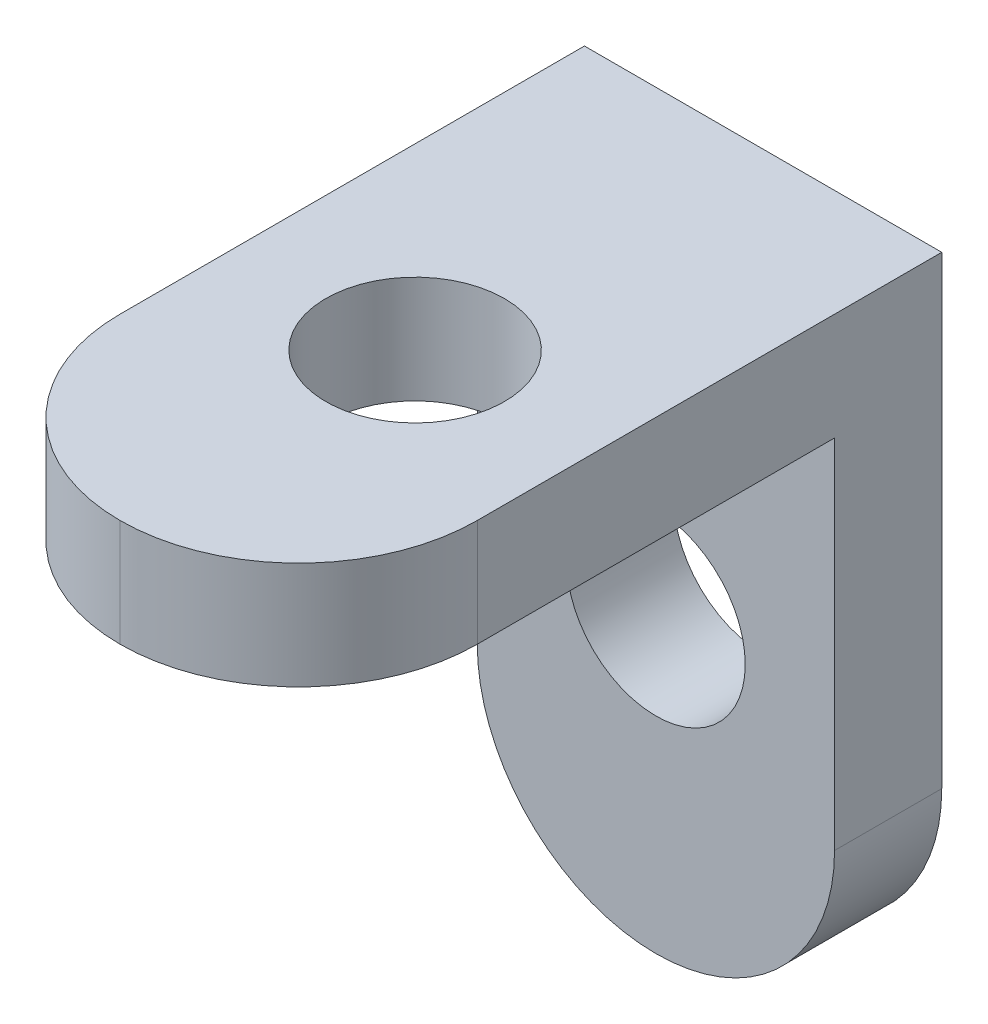
ISO-10303-21;
HEADER;
FILE_DESCRIPTION(('STEP AP214'),'2;1');
FILE_NAME('part.step','',(''),(''),'','','');
FILE_SCHEMA(('AUTOMOTIVE_DESIGN { 1 0 10303 214 1 1 1 1 }'));
ENDSEC;
DATA;
#1=APPLICATION_CONTEXT('core data for automotive mechanical design processes');
#2=APPLICATION_PROTOCOL_DEFINITION('international standard','automotive_design',2000,#1);
#3=PRODUCT_CONTEXT('',#1,'mechanical');
#4=PRODUCT('Part','Part','',(#3));
#5=PRODUCT_RELATED_PRODUCT_CATEGORY('part','',(#4));
#6=PRODUCT_DEFINITION_FORMATION('','',#4);
#7=PRODUCT_DEFINITION_CONTEXT('part definition',#1,'design');
#8=PRODUCT_DEFINITION('design','',#6,#7);
#9=PRODUCT_DEFINITION_SHAPE('','',#8);
#10=(LENGTH_UNIT() NAMED_UNIT(*) SI_UNIT(.MILLI.,.METRE.));
#11=(NAMED_UNIT(*) PLANE_ANGLE_UNIT() SI_UNIT($,.RADIAN.));
#12=(NAMED_UNIT(*) SI_UNIT($,.STERADIAN.) SOLID_ANGLE_UNIT());
#13=UNCERTAINTY_MEASURE_WITH_UNIT(LENGTH_MEASURE(1.E-05),#10,'distance_accuracy_value','');
#14=(GEOMETRIC_REPRESENTATION_CONTEXT(3) GLOBAL_UNCERTAINTY_ASSIGNED_CONTEXT((#13)) GLOBAL_UNIT_ASSIGNED_CONTEXT((#10,
#11,#12)) REPRESENTATION_CONTEXT('',''));
#15=CARTESIAN_POINT('',(0.,0.,0.));
#16=DIRECTION('',(0.,0.,1.));
#17=DIRECTION('',(1.,0.,0.));
#18=AXIS2_PLACEMENT_3D('',#15,#16,#17);
#19=CARTESIAN_POINT('',(0.,0.,3.));
#20=DIRECTION('',(0.,0.,-1.));
#21=DIRECTION('',(-1.,0.,0.));
#22=AXIS2_PLACEMENT_3D('',#19,#20,#21);
#23=PLANE('',#22);
#24=CARTESIAN_POINT('',(5.,-9.74,3.));
#25=DIRECTION('',(0.,0.,1.));
#26=DIRECTION('',(1.,0.,0.));
#27=AXIS2_PLACEMENT_3D('',#24,#25,#26);
#28=CIRCLE('',#27,2.5);
#29=CARTESIAN_POINT('',(7.5,-9.74,3.));
#30=VERTEX_POINT('',#29);
#31=EDGE_CURVE('E130',#30,#30,#28,.T.);
#32=ORIENTED_EDGE('',*,*,#31,.F.);
#33=EDGE_LOOP('',(#32));
#34=FACE_BOUND('',#33,.T.);
#35=DIRECTION('',(1.,0.,0.));
#36=VECTOR('',#35,1.);
#37=CARTESIAN_POINT('',(0.,-3.,3.));
#38=LINE('',#37,#36);
#39=CARTESIAN_POINT('',(0.,-3.,3.));
#40=VERTEX_POINT('',#39);
#41=CARTESIAN_POINT('',(10.,-3.,3.));
#42=VERTEX_POINT('',#41);
#43=EDGE_CURVE('E106',#40,#42,#38,.T.);
#44=ORIENTED_EDGE('',*,*,#43,.F.);
#45=DIRECTION('',(0.,-1.,0.));
#46=VECTOR('',#45,1.);
#47=CARTESIAN_POINT('',(0.,-18.,3.));
#48=LINE('',#47,#46);
#49=CARTESIAN_POINT('',(0.,-13.,3.));
#50=VERTEX_POINT('',#49);
#51=EDGE_CURVE('E114',#40,#50,#48,.T.);
#52=ORIENTED_EDGE('',*,*,#51,.T.);
#53=CARTESIAN_POINT('',(5.,-13.,3.));
#54=DIRECTION('',(0.,0.,-1.));
#55=DIRECTION('',(-1.,0.,0.));
#56=AXIS2_PLACEMENT_3D('',#53,#54,#55);
#57=CIRCLE('',#56,5.);
#58=CARTESIAN_POINT('',(5.,-18.,3.));
#59=VERTEX_POINT('',#58);
#60=EDGE_CURVE('E151',#50,#59,#57,.F.);
#61=ORIENTED_EDGE('',*,*,#60,.T.);
#62=CARTESIAN_POINT('',(5.,-13.,3.));
#63=DIRECTION('',(0.,0.,-1.));
#64=DIRECTION('',(-1.,0.,0.));
#65=AXIS2_PLACEMENT_3D('',#62,#63,#64);
#66=CIRCLE('',#65,5.);
#67=CARTESIAN_POINT('',(10.,-13.,3.));
#68=VERTEX_POINT('',#67);
#69=EDGE_CURVE('E112',#59,#68,#66,.F.);
#70=ORIENTED_EDGE('',*,*,#69,.T.);
#71=DIRECTION('',(0.,1.,0.));
#72=VECTOR('',#71,1.);
#73=CARTESIAN_POINT('',(10.,0.,3.));
#74=LINE('',#73,#72);
#75=EDGE_CURVE('E100',#68,#42,#74,.T.);
#76=ORIENTED_EDGE('',*,*,#75,.T.);
#77=EDGE_LOOP('',(#44,#52,#61,#70,#76));
#78=FACE_BOUND('',#77,.T.);
#79=ADVANCED_FACE('F33',(#34,#78),#23,.F.);
#80=CARTESIAN_POINT('',(0.,-18.,3.));
#81=DIRECTION('',(1.,0.,0.));
#82=DIRECTION('',(0.,0.,-1.));
#83=AXIS2_PLACEMENT_3D('',#80,#81,#82);
#84=PLANE('',#83);
#85=DIRECTION('',(0.,0.,-1.));
#86=VECTOR('',#85,1.);
#87=CARTESIAN_POINT('',(0.,-3.,18.));
#88=LINE('',#87,#86);
#89=CARTESIAN_POINT('',(0.,-3.,13.));
#90=VERTEX_POINT('',#89);
#91=EDGE_CURVE('E105',#90,#40,#88,.T.);
#92=ORIENTED_EDGE('',*,*,#91,.F.);
#93=DIRECTION('',(0.,-1.,0.));
#94=VECTOR('',#93,1.);
#95=CARTESIAN_POINT('',(0.,0.,13.));
#96=LINE('',#95,#94);
#97=CARTESIAN_POINT('',(0.,0.,13.));
#98=VERTEX_POINT('',#97);
#99=EDGE_CURVE('E11',#90,#98,#96,.F.);
#100=ORIENTED_EDGE('',*,*,#99,.T.);
#101=DIRECTION('',(0.,0.,-1.));
#102=VECTOR('',#101,1.);
#103=CARTESIAN_POINT('',(0.,0.,3.));
#104=LINE('',#103,#102);
#105=CARTESIAN_POINT('',(0.,0.,0.));
#106=VERTEX_POINT('',#105);
#107=EDGE_CURVE('E113',#98,#106,#104,.T.);
#108=ORIENTED_EDGE('',*,*,#107,.T.);
#109=DIRECTION('',(0.,-1.,0.));
#110=VECTOR('',#109,1.);
#111=CARTESIAN_POINT('',(0.,-18.,0.));
#112=LINE('',#111,#110);
#113=CARTESIAN_POINT('',(0.,-13.,0.));
#114=VERTEX_POINT('',#113);
#115=EDGE_CURVE('E129',#106,#114,#112,.T.);
#116=ORIENTED_EDGE('',*,*,#115,.T.);
#117=DIRECTION('',(0.,0.,-1.));
#118=VECTOR('',#117,1.);
#119=CARTESIAN_POINT('',(0.,-13.,3.));
#120=LINE('',#119,#118);
#121=EDGE_CURVE('E154',#114,#50,#120,.F.);
#122=ORIENTED_EDGE('',*,*,#121,.T.);
#123=ORIENTED_EDGE('',*,*,#51,.F.);
#124=EDGE_LOOP('',(#92,#100,#108,#116,#122,#123));
#125=FACE_BOUND('',#124,.T.);
#126=ADVANCED_FACE('F178',(#125),#84,.F.);
#127=CARTESIAN_POINT('',(10.,0.,3.));
#128=DIRECTION('',(-1.,0.,0.));
#129=DIRECTION('',(0.,-1.,0.));
#130=AXIS2_PLACEMENT_3D('',#127,#128,#129);
#131=PLANE('',#130);
#132=DIRECTION('',(0.,0.,-1.));
#133=VECTOR('',#132,1.);
#134=CARTESIAN_POINT('',(10.,0.,3.));
#135=LINE('',#134,#133);
#136=CARTESIAN_POINT('',(10.,0.,13.));
#137=VERTEX_POINT('',#136);
#138=CARTESIAN_POINT('',(10.,0.,0.));
#139=VERTEX_POINT('',#138);
#140=EDGE_CURVE('E143',#137,#139,#135,.T.);
#141=ORIENTED_EDGE('',*,*,#140,.F.);
#142=DIRECTION('',(0.,1.,0.));
#143=VECTOR('',#142,1.);
#144=CARTESIAN_POINT('',(10.,-3.,13.));
#145=LINE('',#144,#143);
#146=CARTESIAN_POINT('',(10.,-3.,13.));
#147=VERTEX_POINT('',#146);
#148=EDGE_CURVE('E103',#137,#147,#145,.F.);
#149=ORIENTED_EDGE('',*,*,#148,.T.);
#150=DIRECTION('',(0.,0.,-1.));
#151=VECTOR('',#150,1.);
#152=CARTESIAN_POINT('',(10.,-3.,18.));
#153=LINE('',#152,#151);
#154=EDGE_CURVE('E95',#147,#42,#153,.T.);
#155=ORIENTED_EDGE('',*,*,#154,.T.);
#156=ORIENTED_EDGE('',*,*,#75,.F.);
#157=DIRECTION('',(0.,0.,-1.));
#158=VECTOR('',#157,1.);
#159=CARTESIAN_POINT('',(10.,-13.,3.));
#160=LINE('',#159,#158);
#161=CARTESIAN_POINT('',(10.,-13.,0.));
#162=VERTEX_POINT('',#161);
#163=EDGE_CURVE('E145',#68,#162,#160,.T.);
#164=ORIENTED_EDGE('',*,*,#163,.T.);
#165=DIRECTION('',(0.,1.,0.));
#166=VECTOR('',#165,1.);
#167=CARTESIAN_POINT('',(10.,0.,0.));
#168=LINE('',#167,#166);
#169=EDGE_CURVE('E137',#162,#139,#168,.T.);
#170=ORIENTED_EDGE('',*,*,#169,.T.);
#171=EDGE_LOOP('',(#141,#149,#155,#156,#164,#170));
#172=FACE_BOUND('',#171,.T.);
#173=ADVANCED_FACE('F98',(#172),#131,.F.);
#174=CARTESIAN_POINT('',(0.,0.,3.));
#175=DIRECTION('',(0.,-1.,0.));
#176=DIRECTION('',(0.,0.,-1.));
#177=AXIS2_PLACEMENT_3D('',#174,#175,#176);
#178=PLANE('',#177);
#179=CARTESIAN_POINT('',(5.,0.,9.74));
#180=DIRECTION('',(0.,-1.,0.));
#181=DIRECTION('',(0.,0.,-1.));
#182=AXIS2_PLACEMENT_3D('',#179,#180,#181);
#183=CIRCLE('',#182,2.5);
#184=CARTESIAN_POINT('',(5.,0.,7.24));
#185=VERTEX_POINT('',#184);
#186=EDGE_CURVE('E119',#185,#185,#183,.T.);
#187=ORIENTED_EDGE('',*,*,#186,.T.);
#188=EDGE_LOOP('',(#187));
#189=FACE_BOUND('',#188,.T.);
#190=CARTESIAN_POINT('',(5.,0.,13.));
#191=DIRECTION('',(0.,-1.,0.));
#192=DIRECTION('',(0.,0.,-1.));
#193=AXIS2_PLACEMENT_3D('',#190,#191,#192);
#194=CIRCLE('',#193,5.);
#195=CARTESIAN_POINT('',(5.,0.,18.));
#196=VERTEX_POINT('',#195);
#197=EDGE_CURVE('E157',#98,#196,#194,.F.);
#198=ORIENTED_EDGE('',*,*,#197,.T.);
#199=CARTESIAN_POINT('',(5.,0.,13.));
#200=DIRECTION('',(0.,-1.,0.));
#201=DIRECTION('',(0.,0.,-1.));
#202=AXIS2_PLACEMENT_3D('',#199,#200,#201);
#203=CIRCLE('',#202,5.);
#204=EDGE_CURVE('E161',#196,#137,#203,.F.);
#205=ORIENTED_EDGE('',*,*,#204,.T.);
#206=ORIENTED_EDGE('',*,*,#140,.T.);
#207=DIRECTION('',(-1.,0.,0.));
#208=VECTOR('',#207,1.);
#209=CARTESIAN_POINT('',(0.,0.,0.));
#210=LINE('',#209,#208);
#211=EDGE_CURVE('E133',#139,#106,#210,.T.);
#212=ORIENTED_EDGE('',*,*,#211,.T.);
#213=ORIENTED_EDGE('',*,*,#107,.F.);
#214=EDGE_LOOP('',(#198,#205,#206,#212,#213));
#215=FACE_BOUND('',#214,.T.);
#216=ADVANCED_FACE('F167',(#189,#215),#178,.F.);
#217=CARTESIAN_POINT('',(0.,0.,0.));
#218=DIRECTION('',(0.,0.,-1.));
#219=DIRECTION('',(-1.,0.,0.));
#220=AXIS2_PLACEMENT_3D('',#217,#218,#219);
#221=PLANE('',#220);
#222=CARTESIAN_POINT('',(5.,-9.74,0.));
#223=DIRECTION('',(0.,0.,1.));
#224=DIRECTION('',(1.,0.,0.));
#225=AXIS2_PLACEMENT_3D('',#222,#223,#224);
#226=CIRCLE('',#225,2.5);
#227=CARTESIAN_POINT('',(7.5,-9.74,0.));
#228=VERTEX_POINT('',#227);
#229=EDGE_CURVE('E126',#228,#228,#226,.T.);
#230=ORIENTED_EDGE('',*,*,#229,.T.);
#231=EDGE_LOOP('',(#230));
#232=FACE_BOUND('',#231,.T.);
#233=ORIENTED_EDGE('',*,*,#169,.F.);
#234=CARTESIAN_POINT('',(5.,-13.,0.));
#235=DIRECTION('',(0.,0.,-1.));
#236=DIRECTION('',(-1.,0.,0.));
#237=AXIS2_PLACEMENT_3D('',#234,#235,#236);
#238=CIRCLE('',#237,5.);
#239=CARTESIAN_POINT('',(5.,-18.,0.));
#240=VERTEX_POINT('',#239);
#241=EDGE_CURVE('E149',#162,#240,#238,.T.);
#242=ORIENTED_EDGE('',*,*,#241,.T.);
#243=CARTESIAN_POINT('',(5.,-13.,0.));
#244=DIRECTION('',(0.,0.,-1.));
#245=DIRECTION('',(-1.,0.,0.));
#246=AXIS2_PLACEMENT_3D('',#243,#244,#245);
#247=CIRCLE('',#246,5.);
#248=EDGE_CURVE('E147',#240,#114,#247,.T.);
#249=ORIENTED_EDGE('',*,*,#248,.T.);
#250=ORIENTED_EDGE('',*,*,#115,.F.);
#251=ORIENTED_EDGE('',*,*,#211,.F.);
#252=EDGE_LOOP('',(#233,#242,#249,#250,#251));
#253=FACE_BOUND('',#252,.T.);
#254=ADVANCED_FACE('F181',(#232,#253),#221,.T.);
#255=CARTESIAN_POINT('',(5.,-9.74,0.));
#256=DIRECTION('',(0.,0.,1.));
#257=DIRECTION('',(1.,0.,0.));
#258=AXIS2_PLACEMENT_3D('',#255,#256,#257);
#259=CYLINDRICAL_SURFACE('',#258,2.5);
#260=ORIENTED_EDGE('',*,*,#229,.F.);
#261=EDGE_LOOP('',(#260));
#262=FACE_BOUND('',#261,.T.);
#263=ORIENTED_EDGE('',*,*,#31,.T.);
#264=EDGE_LOOP('',(#263));
#265=FACE_BOUND('',#264,.T.);
#266=ADVANCED_FACE('F198',(#262,#265),#259,.F.);
#267=CARTESIAN_POINT('',(5.,-13.,3.));
#268=DIRECTION('',(0.,0.,-1.));
#269=DIRECTION('',(-1.,0.,0.));
#270=AXIS2_PLACEMENT_3D('',#267,#268,#269);
#271=CYLINDRICAL_SURFACE('',#270,5.);
#272=DIRECTION('',(0.,0.,-1.));
#273=VECTOR('',#272,1.);
#274=CARTESIAN_POINT('',(5.,-18.,3.));
#275=LINE('',#274,#273);
#276=EDGE_CURVE('E125',#59,#240,#275,.T.);
#277=ORIENTED_EDGE('',*,*,#276,.F.);
#278=ORIENTED_EDGE('',*,*,#60,.F.);
#279=ORIENTED_EDGE('',*,*,#121,.F.);
#280=ORIENTED_EDGE('',*,*,#248,.F.);
#281=EDGE_LOOP('',(#277,#278,#279,#280));
#282=FACE_BOUND('',#281,.T.);
#283=ADVANCED_FACE('F187',(#282),#271,.T.);
#284=CARTESIAN_POINT('',(5.,-13.,3.));
#285=DIRECTION('',(0.,0.,-1.));
#286=DIRECTION('',(-1.,0.,0.));
#287=AXIS2_PLACEMENT_3D('',#284,#285,#286);
#288=CYLINDRICAL_SURFACE('',#287,5.);
#289=ORIENTED_EDGE('',*,*,#69,.F.);
#290=ORIENTED_EDGE('',*,*,#276,.T.);
#291=ORIENTED_EDGE('',*,*,#241,.F.);
#292=ORIENTED_EDGE('',*,*,#163,.F.);
#293=EDGE_LOOP('',(#289,#290,#291,#292));
#294=FACE_BOUND('',#293,.T.);
#295=ADVANCED_FACE('F189',(#294),#288,.T.);
#296=CARTESIAN_POINT('',(0.,-3.,18.));
#297=DIRECTION('',(0.,1.,0.));
#298=DIRECTION('',(0.,0.,1.));
#299=AXIS2_PLACEMENT_3D('',#296,#297,#298);
#300=PLANE('',#299);
#301=CARTESIAN_POINT('',(5.,-3.,9.74));
#302=DIRECTION('',(0.,-1.,0.));
#303=DIRECTION('',(0.,0.,-1.));
#304=AXIS2_PLACEMENT_3D('',#301,#302,#303);
#305=CIRCLE('',#304,2.5);
#306=CARTESIAN_POINT('',(5.,-3.,7.24));
#307=VERTEX_POINT('',#306);
#308=EDGE_CURVE('E121',#307,#307,#305,.T.);
#309=ORIENTED_EDGE('',*,*,#308,.F.);
#310=EDGE_LOOP('',(#309));
#311=FACE_BOUND('',#310,.T.);
#312=ORIENTED_EDGE('',*,*,#154,.F.);
#313=CARTESIAN_POINT('',(5.,-3.,13.));
#314=DIRECTION('',(0.,1.,0.));
#315=DIRECTION('',(0.,0.,1.));
#316=AXIS2_PLACEMENT_3D('',#313,#314,#315);
#317=CIRCLE('',#316,5.);
#318=CARTESIAN_POINT('',(5.,-3.,18.));
#319=VERTEX_POINT('',#318);
#320=EDGE_CURVE('E42',#147,#319,#317,.F.);
#321=ORIENTED_EDGE('',*,*,#320,.T.);
#322=CARTESIAN_POINT('',(5.,-3.,13.));
#323=DIRECTION('',(0.,1.,0.));
#324=DIRECTION('',(0.,0.,1.));
#325=AXIS2_PLACEMENT_3D('',#322,#323,#324);
#326=CIRCLE('',#325,5.);
#327=EDGE_CURVE('E49',#319,#90,#326,.F.);
#328=ORIENTED_EDGE('',*,*,#327,.T.);
#329=ORIENTED_EDGE('',*,*,#91,.T.);
#330=ORIENTED_EDGE('',*,*,#43,.T.);
#331=EDGE_LOOP('',(#312,#321,#328,#329,#330));
#332=FACE_BOUND('',#331,.T.);
#333=ADVANCED_FACE('F116',(#311,#332),#300,.F.);
#334=CARTESIAN_POINT('',(5.,0.,13.));
#335=DIRECTION('',(0.,1.,0.));
#336=DIRECTION('',(0.,0.,1.));
#337=AXIS2_PLACEMENT_3D('',#334,#335,#336);
#338=CYLINDRICAL_SURFACE('',#337,5.);
#339=ORIENTED_EDGE('',*,*,#99,.F.);
#340=ORIENTED_EDGE('',*,*,#327,.F.);
#341=DIRECTION('',(0.,-1.,0.));
#342=VECTOR('',#341,1.);
#343=CARTESIAN_POINT('',(5.,-3.,18.));
#344=LINE('',#343,#342);
#345=EDGE_CURVE('E37',#196,#319,#344,.T.);
#346=ORIENTED_EDGE('',*,*,#345,.F.);
#347=ORIENTED_EDGE('',*,*,#197,.F.);
#348=EDGE_LOOP('',(#339,#340,#346,#347));
#349=FACE_BOUND('',#348,.T.);
#350=ADVANCED_FACE('F35',(#349),#338,.T.);
#351=CARTESIAN_POINT('',(5.,0.,13.));
#352=DIRECTION('',(0.,-1.,0.));
#353=DIRECTION('',(1.,0.,0.));
#354=AXIS2_PLACEMENT_3D('',#351,#352,#353);
#355=CYLINDRICAL_SURFACE('',#354,5.);
#356=ORIENTED_EDGE('',*,*,#320,.F.);
#357=ORIENTED_EDGE('',*,*,#148,.F.);
#358=ORIENTED_EDGE('',*,*,#204,.F.);
#359=ORIENTED_EDGE('',*,*,#345,.T.);
#360=EDGE_LOOP('',(#356,#357,#358,#359));
#361=FACE_BOUND('',#360,.T.);
#362=ADVANCED_FACE('F174',(#361),#355,.T.);
#363=CARTESIAN_POINT('',(5.,0.,9.74));
#364=DIRECTION('',(0.,-1.,0.));
#365=DIRECTION('',(0.,0.,-1.));
#366=AXIS2_PLACEMENT_3D('',#363,#364,#365);
#367=CYLINDRICAL_SURFACE('',#366,2.5);
#368=ORIENTED_EDGE('',*,*,#186,.F.);
#369=EDGE_LOOP('',(#368));
#370=FACE_BOUND('',#369,.T.);
#371=ORIENTED_EDGE('',*,*,#308,.T.);
#372=EDGE_LOOP('',(#371));
#373=FACE_BOUND('',#372,.T.);
#374=ADVANCED_FACE('F292',(#370,#373),#367,.F.);
#375=CLOSED_SHELL('',(#79,#126,#173,#216,#254,#266,#283,#295,#333,#350,#362,#374));
#376=MANIFOLD_SOLID_BREP('B2',#375);
#377=ADVANCED_BREP_SHAPE_REPRESENTATION('',(#18,#376),#14);
#378=SHAPE_DEFINITION_REPRESENTATION(#9,#377);
ENDSEC;
END-ISO-10303-21;
